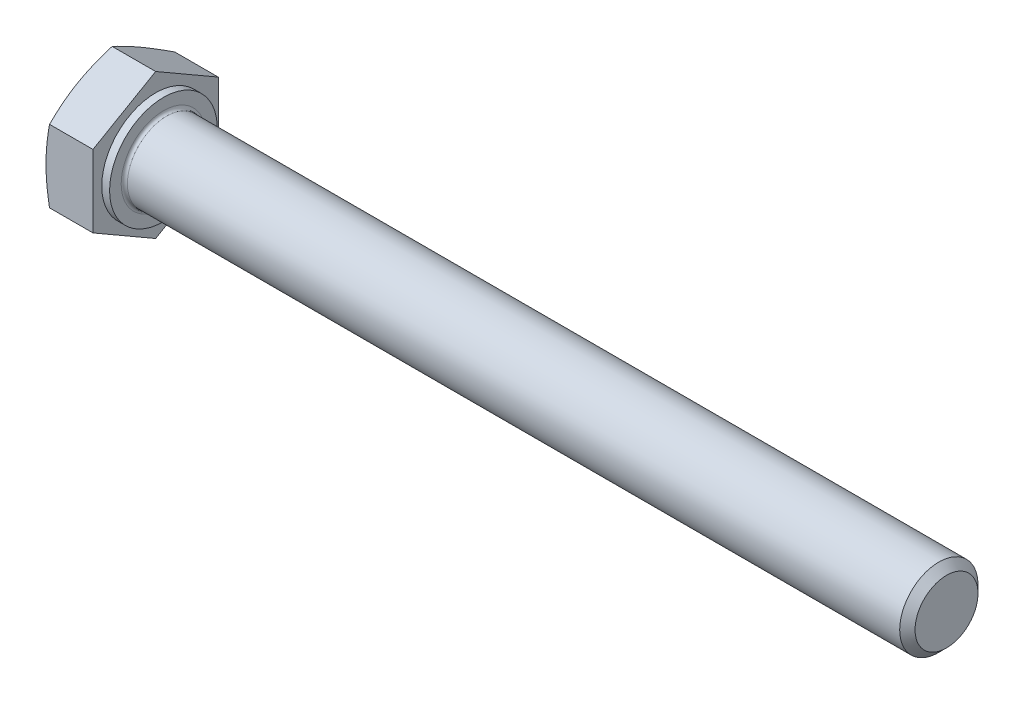
ISO-10303-21;
HEADER;
FILE_DESCRIPTION(('STEP AP214'),'2;1');
FILE_NAME('part.step','',(''),(''),'','','');
FILE_SCHEMA(('AUTOMOTIVE_DESIGN { 1 0 10303 214 1 1 1 1 }'));
ENDSEC;
DATA;
#1=APPLICATION_CONTEXT('core data for automotive mechanical design processes');
#2=APPLICATION_PROTOCOL_DEFINITION('international standard','automotive_design',2000,#1);
#3=PRODUCT_CONTEXT('',#1,'mechanical');
#4=PRODUCT('Part','Part','',(#3));
#5=PRODUCT_RELATED_PRODUCT_CATEGORY('part','',(#4));
#6=PRODUCT_DEFINITION_FORMATION('','',#4);
#7=PRODUCT_DEFINITION_CONTEXT('part definition',#1,'design');
#8=PRODUCT_DEFINITION('design','',#6,#7);
#9=PRODUCT_DEFINITION_SHAPE('','',#8);
#10=(LENGTH_UNIT() NAMED_UNIT(*) SI_UNIT(.MILLI.,.METRE.));
#11=(NAMED_UNIT(*) PLANE_ANGLE_UNIT() SI_UNIT($,.RADIAN.));
#12=(NAMED_UNIT(*) SI_UNIT($,.STERADIAN.) SOLID_ANGLE_UNIT());
#13=UNCERTAINTY_MEASURE_WITH_UNIT(LENGTH_MEASURE(1.E-05),#10,'distance_accuracy_value','');
#14=(GEOMETRIC_REPRESENTATION_CONTEXT(3) GLOBAL_UNCERTAINTY_ASSIGNED_CONTEXT((#13)) GLOBAL_UNIT_ASSIGNED_CONTEXT((#10,
#11,#12)) REPRESENTATION_CONTEXT('',''));
#15=CARTESIAN_POINT('',(0.,0.,0.));
#16=DIRECTION('',(0.,0.,1.));
#17=DIRECTION('',(1.,0.,0.));
#18=AXIS2_PLACEMENT_3D('',#15,#16,#17);
#19=CARTESIAN_POINT('',(-3.5,2.,0.));
#20=DIRECTION('',(-1.,0.,0.));
#21=DIRECTION('',(0.,0.,1.));
#22=AXIS2_PLACEMENT_3D('',#19,#20,#21);
#23=PLANE('',#22);
#24=CARTESIAN_POINT('',(-3.49999999997659,0.,0.));
#25=DIRECTION('',(1.,0.,0.));
#26=DIRECTION('',(0.,0.,-1.));
#27=AXIS2_PLACEMENT_3D('',#24,#25,#26);
#28=CIRCLE('',#27,4.00000000007594);
#29=CARTESIAN_POINT('',(-3.49999999999041,0.,4.00000000003797));
#30=VERTEX_POINT('',#29);
#31=CARTESIAN_POINT('',(-3.49999999999041,-3.46410161517064,2.00000000001898));
#32=VERTEX_POINT('',#31);
#33=EDGE_CURVE('E91',#30,#32,#28,.T.);
#34=ORIENTED_EDGE('',*,*,#33,.F.);
#35=CARTESIAN_POINT('',(-3.49999999997659,0.,0.));
#36=DIRECTION('',(1.,0.,0.));
#37=DIRECTION('',(0.,0.,-1.));
#38=AXIS2_PLACEMENT_3D('',#35,#36,#37);
#39=CIRCLE('',#38,4.00000000007594);
#40=CARTESIAN_POINT('',(-3.49999999999041,3.46410161517064,2.00000000001898));
#41=VERTEX_POINT('',#40);
#42=EDGE_CURVE('E88',#41,#30,#39,.T.);
#43=ORIENTED_EDGE('',*,*,#42,.F.);
#44=CARTESIAN_POINT('',(-3.49999999997659,0.,0.));
#45=DIRECTION('',(1.,0.,0.));
#46=DIRECTION('',(0.,0.,-1.));
#47=AXIS2_PLACEMENT_3D('',#44,#45,#46);
#48=CIRCLE('',#47,4.00000000007594);
#49=CARTESIAN_POINT('',(-3.49999999999041,3.46410161517064,-2.00000000001899));
#50=VERTEX_POINT('',#49);
#51=EDGE_CURVE('E20',#50,#41,#48,.T.);
#52=ORIENTED_EDGE('',*,*,#51,.F.);
#53=CARTESIAN_POINT('',(-3.49999999997659,0.,0.));
#54=DIRECTION('',(1.,0.,0.));
#55=DIRECTION('',(0.,0.,-1.));
#56=AXIS2_PLACEMENT_3D('',#53,#54,#55);
#57=CIRCLE('',#56,4.00000000007594);
#58=CARTESIAN_POINT('',(-3.49999999999041,0.,-4.00000000003797));
#59=VERTEX_POINT('',#58);
#60=EDGE_CURVE('E458',#59,#50,#57,.T.);
#61=ORIENTED_EDGE('',*,*,#60,.F.);
#62=CARTESIAN_POINT('',(-3.49999999997659,0.,0.));
#63=DIRECTION('',(1.,0.,0.));
#64=DIRECTION('',(0.,0.,-1.));
#65=AXIS2_PLACEMENT_3D('',#62,#63,#64);
#66=CIRCLE('',#65,4.00000000007594);
#67=CARTESIAN_POINT('',(-3.49999999999041,-3.46410161517064,-2.00000000001898));
#68=VERTEX_POINT('',#67);
#69=EDGE_CURVE('E144',#68,#59,#66,.T.);
#70=ORIENTED_EDGE('',*,*,#69,.F.);
#71=CARTESIAN_POINT('',(-3.49999999997659,0.,0.));
#72=DIRECTION('',(1.,0.,0.));
#73=DIRECTION('',(0.,0.,-1.));
#74=AXIS2_PLACEMENT_3D('',#71,#72,#73);
#75=CIRCLE('',#74,4.00000000007594);
#76=EDGE_CURVE('E461',#32,#68,#75,.T.);
#77=ORIENTED_EDGE('',*,*,#76,.F.);
#78=EDGE_LOOP('',(#34,#43,#52,#61,#70,#77));
#79=FACE_BOUND('',#78,.T.);
#80=ADVANCED_FACE('F17',(#79),#23,.T.);
#81=CARTESIAN_POINT('',(-3.27342308187895,0.,0.));
#82=DIRECTION('',(1.,0.,0.));
#83=DIRECTION('',(0.,0.,-1.));
#84=AXIS2_PLACEMENT_3D('',#81,#82,#83);
#85=CONICAL_SURFACE('',#84,4.62251496634281,1.22173047640841);
#86=CARTESIAN_POINT('',(-3.27477443523247,4.61880215351814,1.9678651007818E-12));
#87=CARTESIAN_POINT('',(-3.30947465057823,4.52349006431418,-0.165085381074832));
#88=CARTESIAN_POINT('',(-3.34105286383211,4.42786762538426,-0.330708303645098));
#89=CARTESIAN_POINT('',(-3.39656371900765,4.23627675616722,-0.662553423395305));
#90=CARTESIAN_POINT('',(-3.42051210955656,4.14030945750729,-0.828773660539435));
#91=CARTESIAN_POINT('',(-3.45952558471782,3.94786485008672,-1.16209749823451));
#92=CARTESIAN_POINT('',(-3.47458678229017,3.85138733675634,-1.32920145311064));
#93=CARTESIAN_POINT('',(-3.48977188057655,3.70638377667277,-1.58035498645374));
#94=CARTESIAN_POINT('',(-3.49359924532291,3.65794973846843,-1.66424520143939));
#95=CARTESIAN_POINT('',(-3.4987165806347,3.56104518672895,-1.83208880853686));
#96=CARTESIAN_POINT('',(-3.50000638935347,3.51257467106449,-1.91604220433678));
#97=CARTESIAN_POINT('',(-3.50000000000423,3.4641016151372,-2.00000000000096));
#98=B_SPLINE_CURVE_WITH_KNOTS('',3,(#86,#87,#88,#89,#90,#91,#92,#93,#94,#95,#96,#97),
.UNSPECIFIED.,.F.,.F.,(4,2,2,2,2,4),(0.,0.58131973204969,1.16143167607339,1.74179715910975,
2.03259877876568,2.32341894530133),.UNSPECIFIED.);
#99=CARTESIAN_POINT('',(-3.27477443523247,4.61880215351814,0.));
#100=VERTEX_POINT('',#99);
#101=EDGE_CURVE('E108',#100,#50,#98,.T.);
#102=ORIENTED_EDGE('',*,*,#101,.T.);
#103=ORIENTED_EDGE('',*,*,#51,.T.);
#104=CARTESIAN_POINT('',(-3.5000000000103,3.46410161514526,2.00000000000433));
#105=CARTESIAN_POINT('',(-3.5000063893557,3.51257467106773,1.91604220433754));
#106=CARTESIAN_POINT('',(-3.4987165806353,3.56104518673013,1.83208880853657));
#107=CARTESIAN_POINT('',(-3.49359924532227,3.657949738468,1.66424520143839));
#108=CARTESIAN_POINT('',(-3.48977188057631,3.7063837766728,1.58035498645309));
#109=CARTESIAN_POINT('',(-3.47458678229057,3.85138733675708,1.32920145311058));
#110=CARTESIAN_POINT('',(-3.45952558471791,3.94786485008704,1.16209749823431));
#111=CARTESIAN_POINT('',(-3.42051210955641,4.14030945750725,0.828773660539154));
#112=CARTESIAN_POINT('',(-3.39656371900756,4.23627675616725,0.662553423395082));
#113=CARTESIAN_POINT('',(-3.34105286383215,4.4278676253844,0.330708303645032));
#114=CARTESIAN_POINT('',(-3.30947465057834,4.52349006431436,0.165085381074863));
#115=CARTESIAN_POINT('',(-3.27477443523247,4.61880215351814,-1.96868278240485E-12));
#116=B_SPLINE_CURVE_WITH_KNOTS('',3,(#104,#105,#106,#107,#108,#109,#110,#111,#112,#113,#114,
#115),.UNSPECIFIED.,.F.,.F.,(4,2,2,2,2,4),(0.,0.29082016653535,0.581621786191063,
1.16198726922716,1.74209921325081,2.3234189453003),.UNSPECIFIED.);
#117=EDGE_CURVE('E102',#41,#100,#116,.T.);
#118=ORIENTED_EDGE('',*,*,#117,.T.);
#119=EDGE_LOOP('',(#102,#103,#118));
#120=FACE_BOUND('',#119,.T.);
#121=ADVANCED_FACE('F106',(#120),#85,.T.);
#122=CARTESIAN_POINT('',(-3.27342308187895,0.,0.));
#123=DIRECTION('',(1.,0.,0.));
#124=DIRECTION('',(0.,0.,-1.));
#125=AXIS2_PLACEMENT_3D('',#122,#123,#124);
#126=CONICAL_SURFACE('',#125,4.62251496634281,1.22173047640841);
#127=CARTESIAN_POINT('',(-3.27477443523247,2.30940107675737,4.00000000000197));
#128=CARTESIAN_POINT('',(-3.30947465057823,2.40471316596133,3.83491461892517));
#129=CARTESIAN_POINT('',(-3.34105286383211,2.50033560489125,3.6692916963549));
#130=CARTESIAN_POINT('',(-3.39656371900765,2.69192647410829,3.3374465766047));
#131=CARTESIAN_POINT('',(-3.42051210955656,2.78789377276822,3.17122633946057));
#132=CARTESIAN_POINT('',(-3.45952558471782,2.98033838018879,2.83790250176549));
#133=CARTESIAN_POINT('',(-3.47458678229017,3.07681589351917,2.67079854688936));
#134=CARTESIAN_POINT('',(-3.48977188057655,3.22181945360274,2.41964501354626));
#135=CARTESIAN_POINT('',(-3.49359924532291,3.27025349180708,2.3357547985606));
#136=CARTESIAN_POINT('',(-3.4987165806347,3.36715804354656,2.16791119146314));
#137=CARTESIAN_POINT('',(-3.50000638935347,3.41562855921102,2.08395779566322));
#138=CARTESIAN_POINT('',(-3.50000000000423,3.46410161513831,1.99999999999904));
#139=B_SPLINE_CURVE_WITH_KNOTS('',3,(#127,#128,#129,#130,#131,#132,#133,#134,#135,#136,#137,
#138),.UNSPECIFIED.,.F.,.F.,(4,2,2,2,2,4),(0.,0.58131973204969,1.16143167607339,
1.74179715910976,2.03259877876568,2.32341894530133),.UNSPECIFIED.);
#140=CARTESIAN_POINT('',(-3.27477443523247,2.30940107675907,4.00000000000098));
#141=VERTEX_POINT('',#140);
#142=EDGE_CURVE('E96',#141,#41,#139,.T.);
#143=ORIENTED_EDGE('',*,*,#142,.T.);
#144=ORIENTED_EDGE('',*,*,#42,.T.);
#145=CARTESIAN_POINT('',(-3.5000000000103,0.,4.00000000000867));
#146=CARTESIAN_POINT('',(-3.5000063893557,0.0969461118544172,4.0000000000032));
#147=CARTESIAN_POINT('',(-3.4987165806353,0.193887143183226,4.00000000000087));
#148=CARTESIAN_POINT('',(-3.49359924532227,0.387696246661998,3.99999999999912));
#149=CARTESIAN_POINT('',(-3.48977188057631,0.484564323070614,3.99999999999969));
#150=CARTESIAN_POINT('',(-3.47458678229057,0.77457144323759,4.00000000000061));
#151=CARTESIAN_POINT('',(-3.45952558471791,0.967526469898265,4.00000000000017));
#152=CARTESIAN_POINT('',(-3.42051210955641,1.3524156847393,3.99999999999983));
#153=CARTESIAN_POINT('',(-3.39656371900756,1.54435028205914,3.99999999999991));
#154=CARTESIAN_POINT('',(-3.34105286383215,1.92753202049315,4.00000000000009));
#155=CARTESIAN_POINT('',(-3.30947465057834,2.11877689835292,4.00000000000017));
#156=CARTESIAN_POINT('',(-3.27477443523247,2.30940107676078,4.));
#157=B_SPLINE_CURVE_WITH_KNOTS('',3,(#145,#146,#147,#148,#149,#150,#151,#152,#153,#154,#155,
#156),.UNSPECIFIED.,.F.,.F.,(4,2,2,2,2,4),(0.,0.29082016653535,0.581621786191063,
1.16198726922716,1.74209921325081,2.3234189453003),.UNSPECIFIED.);
#158=EDGE_CURVE('E98',#30,#141,#157,.T.);
#159=ORIENTED_EDGE('',*,*,#158,.T.);
#160=EDGE_LOOP('',(#143,#144,#159));
#161=FACE_BOUND('',#160,.T.);
#162=ADVANCED_FACE('F97',(#161),#126,.T.);
#163=CARTESIAN_POINT('',(-3.27342308187895,0.,0.));
#164=DIRECTION('',(1.,0.,0.));
#165=DIRECTION('',(0.,0.,-1.));
#166=AXIS2_PLACEMENT_3D('',#163,#164,#165);
#167=CONICAL_SURFACE('',#166,4.62251496634281,1.22173047640841);
#168=CARTESIAN_POINT('',(-3.27477443523247,-2.30940107676078,4.));
#169=CARTESIAN_POINT('',(-3.30947465057823,-2.11877689835285,4.));
#170=CARTESIAN_POINT('',(-3.34105286383211,-1.92753202049302,4.));
#171=CARTESIAN_POINT('',(-3.39656371900765,-1.54435028205893,4.));
#172=CARTESIAN_POINT('',(-3.42051210955656,-1.35241568473908,4.));
#173=CARTESIAN_POINT('',(-3.45952558471782,-0.967526469897932,4.));
#174=CARTESIAN_POINT('',(-3.47458678229017,-0.774571443237161,4.));
#175=CARTESIAN_POINT('',(-3.48977188057655,-0.484564323070031,4.));
#176=CARTESIAN_POINT('',(-3.49359924532291,-0.387696246661349,4.));
#177=CARTESIAN_POINT('',(-3.4987165806347,-0.19388714318239,4.));
#178=CARTESIAN_POINT('',(-3.50000638935347,-0.0969461118534611,4.));
#179=CARTESIAN_POINT('',(-3.50000000000423,1.10484079138364E-12,4.));
#180=B_SPLINE_CURVE_WITH_KNOTS('',3,(#168,#169,#170,#171,#172,#173,#174,#175,#176,#177,#178,
#179),.UNSPECIFIED.,.F.,.F.,(4,2,2,2,2,4),(0.,0.58131973204969,1.16143167607339,
1.74179715910976,2.03259877876568,2.32341894530133),.UNSPECIFIED.);
#181=CARTESIAN_POINT('',(-3.27477443523247,-2.30940107675907,4.00000000000098));
#182=VERTEX_POINT('',#181);
#183=EDGE_CURVE('E115',#182,#30,#180,.T.);
#184=ORIENTED_EDGE('',*,*,#183,.T.);
#185=ORIENTED_EDGE('',*,*,#33,.T.);
#186=CARTESIAN_POINT('',(-3.5000000000103,-3.46410161514526,2.00000000000433));
#187=CARTESIAN_POINT('',(-3.5000063893557,-3.41562855921332,2.08395779566565));
#188=CARTESIAN_POINT('',(-3.4987165806353,-3.3671580435469,2.1679111914643));
#189=CARTESIAN_POINT('',(-3.49359924532227,-3.270253491806,2.33575479856073));
#190=CARTESIAN_POINT('',(-3.48977188057631,-3.22181945360218,2.41964501354661));
#191=CARTESIAN_POINT('',(-3.47458678229057,-3.07681589351949,2.67079854689003));
#192=CARTESIAN_POINT('',(-3.45952558471791,-2.98033838018877,2.83790250176586));
#193=CARTESIAN_POINT('',(-3.42051210955641,-2.78789377276796,3.17122633946067));
#194=CARTESIAN_POINT('',(-3.39656371900756,-2.69192647410811,3.33744657660483));
#195=CARTESIAN_POINT('',(-3.34105286383215,-2.50033560489126,3.66929169635506));
#196=CARTESIAN_POINT('',(-3.30947465057834,-2.40471316596145,3.83491461892531));
#197=CARTESIAN_POINT('',(-3.27477443523247,-2.30940107675737,4.00000000000197));
#198=B_SPLINE_CURVE_WITH_KNOTS('',3,(#186,#187,#188,#189,#190,#191,#192,#193,#194,#195,#196,
#197),.UNSPECIFIED.,.F.,.F.,(4,2,2,2,2,4),(0.,0.290820166535351,0.581621786191064,
1.16198726922716,1.74209921325081,2.32341894530031),.UNSPECIFIED.);
#199=EDGE_CURVE('E219',#32,#182,#198,.T.);
#200=ORIENTED_EDGE('',*,*,#199,.T.);
#201=EDGE_LOOP('',(#184,#185,#200));
#202=FACE_BOUND('',#201,.T.);
#203=ADVANCED_FACE('F209',(#202),#167,.T.);
#204=CARTESIAN_POINT('',(-3.27342308187895,0.,0.));
#205=DIRECTION('',(1.,0.,0.));
#206=DIRECTION('',(0.,0.,-1.));
#207=AXIS2_PLACEMENT_3D('',#204,#205,#206);
#208=CONICAL_SURFACE('',#207,4.62251496634281,1.22173047640841);
#209=ORIENTED_EDGE('',*,*,#76,.T.);
#210=CARTESIAN_POINT('',(-3.5000000000103,-3.46410161514526,-2.00000000000433));
#211=CARTESIAN_POINT('',(-3.5000063893557,-3.51257467106773,-1.91604220433754));
#212=CARTESIAN_POINT('',(-3.4987165806353,-3.56104518673013,-1.83208880853657));
#213=CARTESIAN_POINT('',(-3.49359924532227,-3.657949738468,-1.66424520143839));
#214=CARTESIAN_POINT('',(-3.48977188057631,-3.7063837766728,-1.58035498645308));
#215=CARTESIAN_POINT('',(-3.47458678229057,-3.85138733675708,-1.32920145311058));
#216=CARTESIAN_POINT('',(-3.45952558471791,-3.94786485008704,-1.16209749823431));
#217=CARTESIAN_POINT('',(-3.42051210955641,-4.14030945750725,-0.828773660539154));
#218=CARTESIAN_POINT('',(-3.39656371900756,-4.23627675616725,-0.662553423395082));
#219=CARTESIAN_POINT('',(-3.34105286383215,-4.4278676253844,-0.330708303645031));
#220=CARTESIAN_POINT('',(-3.30947465057834,-4.52349006431436,-0.165085381074863));
#221=CARTESIAN_POINT('',(-3.27477443523247,-4.61880215351814,1.96865973761618E-12));
#222=B_SPLINE_CURVE_WITH_KNOTS('',3,(#210,#211,#212,#213,#214,#215,#216,#217,#218,#219,#220,
#221),.UNSPECIFIED.,.F.,.F.,(4,2,2,2,2,4),(0.,0.29082016653535,0.581621786191063,
1.16198726922716,1.7420992132508,2.3234189453003),.UNSPECIFIED.);
#223=CARTESIAN_POINT('',(-3.27477443523247,-4.61880215351814,0.));
#224=VERTEX_POINT('',#223);
#225=EDGE_CURVE('E201',#68,#224,#222,.T.);
#226=ORIENTED_EDGE('',*,*,#225,.T.);
#227=CARTESIAN_POINT('',(-3.27477443523247,-4.61880215351814,-1.96770084854492E-12));
#228=CARTESIAN_POINT('',(-3.30947465057823,-4.52349006431418,0.165085381074832));
#229=CARTESIAN_POINT('',(-3.34105286383211,-4.42786762538426,0.330708303645098));
#230=CARTESIAN_POINT('',(-3.39656371900765,-4.23627675616722,0.662553423395304));
#231=CARTESIAN_POINT('',(-3.42051210955656,-4.14030945750729,0.828773660539433));
#232=CARTESIAN_POINT('',(-3.45952558471782,-3.94786485008672,1.16209749823451));
#233=CARTESIAN_POINT('',(-3.47458678229017,-3.85138733675634,1.32920145311064));
#234=CARTESIAN_POINT('',(-3.48977188057655,-3.70638377667277,1.58035498645374));
#235=CARTESIAN_POINT('',(-3.49359924532291,-3.65794973846843,1.66424520143939));
#236=CARTESIAN_POINT('',(-3.4987165806347,-3.56104518672895,1.83208880853686));
#237=CARTESIAN_POINT('',(-3.50000638935347,-3.51257467106449,1.91604220433677));
#238=CARTESIAN_POINT('',(-3.50000000000423,-3.4641016151372,2.00000000000096));
#239=B_SPLINE_CURVE_WITH_KNOTS('',3,(#227,#228,#229,#230,#231,#232,#233,#234,#235,#236,#237,
#238),.UNSPECIFIED.,.F.,.F.,(4,2,2,2,2,4),(0.,0.581319732049689,1.16143167607339,
1.74179715910975,2.03259877876568,2.32341894530133),.UNSPECIFIED.);
#240=EDGE_CURVE('E214',#224,#32,#239,.T.);
#241=ORIENTED_EDGE('',*,*,#240,.T.);
#242=EDGE_LOOP('',(#209,#226,#241));
#243=FACE_BOUND('',#242,.T.);
#244=ADVANCED_FACE('F206',(#243),#208,.T.);
#245=CARTESIAN_POINT('',(-3.27342308187895,0.,0.));
#246=DIRECTION('',(1.,0.,0.));
#247=DIRECTION('',(0.,0.,-1.));
#248=AXIS2_PLACEMENT_3D('',#245,#246,#247);
#249=CONICAL_SURFACE('',#248,4.62251496634281,1.22173047640841);
#250=ORIENTED_EDGE('',*,*,#60,.T.);
#251=CARTESIAN_POINT('',(-3.5000000000103,3.46410161514526,-2.00000000000433));
#252=CARTESIAN_POINT('',(-3.5000063893557,3.41562855921331,-2.08395779566565));
#253=CARTESIAN_POINT('',(-3.4987165806353,3.3671580435469,-2.1679111914643));
#254=CARTESIAN_POINT('',(-3.49359924532227,3.270253491806,-2.33575479856073));
#255=CARTESIAN_POINT('',(-3.48977188057631,3.22181945360218,-2.41964501354661));
#256=CARTESIAN_POINT('',(-3.47458678229057,3.07681589351949,-2.67079854689003));
#257=CARTESIAN_POINT('',(-3.45952558471791,2.98033838018877,-2.83790250176586));
#258=CARTESIAN_POINT('',(-3.42051210955641,2.78789377276796,-3.17122633946067));
#259=CARTESIAN_POINT('',(-3.39656371900756,2.69192647410811,-3.33744657660483));
#260=CARTESIAN_POINT('',(-3.34105286383215,2.50033560489126,-3.66929169635505));
#261=CARTESIAN_POINT('',(-3.30947465057834,2.40471316596145,-3.83491461892531));
#262=CARTESIAN_POINT('',(-3.27477443523247,2.30940107675737,-4.00000000000197));
#263=B_SPLINE_CURVE_WITH_KNOTS('',3,(#251,#252,#253,#254,#255,#256,#257,#258,#259,#260,#261,
#262),.UNSPECIFIED.,.F.,.F.,(4,2,2,2,2,4),(0.,0.29082016653535,0.581621786191063,
1.16198726922716,1.74209921325081,2.3234189453003),.UNSPECIFIED.);
#264=CARTESIAN_POINT('',(-3.27477443523268,2.30940107675794,-4.00000000000098));
#265=VERTEX_POINT('',#264);
#266=EDGE_CURVE('E103',#50,#265,#263,.T.);
#267=ORIENTED_EDGE('',*,*,#266,.T.);
#268=CARTESIAN_POINT('',(-3.27477443523247,2.30940107676078,-4.));
#269=CARTESIAN_POINT('',(-3.30947465057823,2.11877689835285,-4.));
#270=CARTESIAN_POINT('',(-3.34105286383211,1.92753202049302,-4.));
#271=CARTESIAN_POINT('',(-3.39656371900765,1.54435028205893,-4.));
#272=CARTESIAN_POINT('',(-3.42051210955656,1.35241568473908,-4.));
#273=CARTESIAN_POINT('',(-3.45952558471782,0.967526469897932,-4.));
#274=CARTESIAN_POINT('',(-3.47458678229017,0.774571443237161,-4.));
#275=CARTESIAN_POINT('',(-3.48977188057655,0.484564323070031,-4.));
#276=CARTESIAN_POINT('',(-3.49359924532291,0.387696246661349,-4.));
#277=CARTESIAN_POINT('',(-3.4987165806347,0.193887143182389,-4.));
#278=CARTESIAN_POINT('',(-3.50000638935347,0.0969461118534606,-4.));
#279=CARTESIAN_POINT('',(-3.50000000000423,-1.10527447225264E-12,-4.));
#280=B_SPLINE_CURVE_WITH_KNOTS('',3,(#268,#269,#270,#271,#272,#273,#274,#275,#276,#277,#278,
#279),.UNSPECIFIED.,.F.,.F.,(4,2,2,2,2,4),(0.,0.58131973204969,1.16143167607339,
1.74179715910976,2.03259877876568,2.32341894530133),.UNSPECIFIED.);
#281=EDGE_CURVE('E180',#265,#59,#280,.T.);
#282=ORIENTED_EDGE('',*,*,#281,.T.);
#283=EDGE_LOOP('',(#250,#267,#282));
#284=FACE_BOUND('',#283,.T.);
#285=ADVANCED_FACE('F159',(#284),#249,.T.);
#286=CARTESIAN_POINT('',(-3.27342308187895,0.,0.));
#287=DIRECTION('',(1.,0.,0.));
#288=DIRECTION('',(0.,0.,-1.));
#289=AXIS2_PLACEMENT_3D('',#286,#287,#288);
#290=CONICAL_SURFACE('',#289,4.62251496634281,1.22173047640841);
#291=ORIENTED_EDGE('',*,*,#69,.T.);
#292=CARTESIAN_POINT('',(-3.5000000000103,0.,-4.00000000000867));
#293=CARTESIAN_POINT('',(-3.5000063893557,-0.0969461118544174,-4.0000000000032));
#294=CARTESIAN_POINT('',(-3.4987165806353,-0.193887143183226,-4.00000000000087));
#295=CARTESIAN_POINT('',(-3.49359924532227,-0.387696246661999,-3.99999999999912));
#296=CARTESIAN_POINT('',(-3.48977188057631,-0.484564323070614,-3.99999999999969));
#297=CARTESIAN_POINT('',(-3.47458678229057,-0.77457144323759,-4.00000000000061));
#298=CARTESIAN_POINT('',(-3.45952558471791,-0.967526469898266,-4.00000000000017));
#299=CARTESIAN_POINT('',(-3.42051210955641,-1.3524156847393,-3.99999999999983));
#300=CARTESIAN_POINT('',(-3.39656371900756,-1.54435028205914,-3.99999999999991));
#301=CARTESIAN_POINT('',(-3.34105286383215,-1.92753202049315,-4.00000000000009));
#302=CARTESIAN_POINT('',(-3.30947465057834,-2.11877689835292,-4.00000000000017));
#303=CARTESIAN_POINT('',(-3.27477443523247,-2.30940107676078,-4.));
#304=B_SPLINE_CURVE_WITH_KNOTS('',3,(#292,#293,#294,#295,#296,#297,#298,#299,#300,#301,#302,
#303),.UNSPECIFIED.,.F.,.F.,(4,2,2,2,2,4),(0.,0.29082016653535,0.581621786191063,
1.16198726922716,1.74209921325081,2.3234189453003),.UNSPECIFIED.);
#305=CARTESIAN_POINT('',(-3.27477443523247,-2.30940107675907,-4.00000000000098));
#306=VERTEX_POINT('',#305);
#307=EDGE_CURVE('E173',#59,#306,#304,.T.);
#308=ORIENTED_EDGE('',*,*,#307,.T.);
#309=CARTESIAN_POINT('',(-3.27477443523247,-2.30940107675737,-4.00000000000197));
#310=CARTESIAN_POINT('',(-3.30947465057823,-2.40471316596133,-3.83491461892517));
#311=CARTESIAN_POINT('',(-3.34105286383211,-2.50033560489125,-3.6692916963549));
#312=CARTESIAN_POINT('',(-3.39656371900765,-2.69192647410829,-3.3374465766047));
#313=CARTESIAN_POINT('',(-3.42051210955656,-2.78789377276822,-3.17122633946057));
#314=CARTESIAN_POINT('',(-3.45952558471782,-2.98033838018879,-2.83790250176549));
#315=CARTESIAN_POINT('',(-3.47458678229017,-3.07681589351918,-2.67079854688936));
#316=CARTESIAN_POINT('',(-3.48977188057655,-3.22181945360274,-2.41964501354625));
#317=CARTESIAN_POINT('',(-3.49359924532291,-3.27025349180708,-2.3357547985606));
#318=CARTESIAN_POINT('',(-3.4987165806347,-3.36715804354656,-2.16791119146314));
#319=CARTESIAN_POINT('',(-3.50000638935347,-3.41562855921102,-2.08395779566322));
#320=CARTESIAN_POINT('',(-3.50000000000423,-3.46410161513831,-1.99999999999904));
#321=B_SPLINE_CURVE_WITH_KNOTS('',3,(#309,#310,#311,#312,#313,#314,#315,#316,#317,#318,#319,
#320),.UNSPECIFIED.,.F.,.F.,(4,2,2,2,2,4),(0.,0.58131973204969,1.16143167607339,
1.74179715910976,2.03259877876569,2.32341894530133),.UNSPECIFIED.);
#322=EDGE_CURVE('E165',#306,#68,#321,.T.);
#323=ORIENTED_EDGE('',*,*,#322,.T.);
#324=EDGE_LOOP('',(#291,#308,#323));
#325=FACE_BOUND('',#324,.T.);
#326=ADVANCED_FACE('F154',(#325),#290,.T.);
#327=CARTESIAN_POINT('',(0.,4.61880215351701,0.));
#328=DIRECTION('',(0.,-0.866025403784439,0.5));
#329=DIRECTION('',(0.,-0.5,-0.866025403784439));
#330=AXIS2_PLACEMENT_3D('',#327,#328,#329);
#331=PLANE('',#330);
#332=DIRECTION('',(1.,0.,0.));
#333=VECTOR('',#332,1.);
#334=CARTESIAN_POINT('',(0.,2.3094010767585,-4.));
#335=LINE('',#334,#333);
#336=CARTESIAN_POINT('',(-0.5,2.3094010767585,-4.));
#337=VERTEX_POINT('',#336);
#338=EDGE_CURVE('E338',#337,#265,#335,.F.);
#339=ORIENTED_EDGE('',*,*,#338,.T.);
#340=ORIENTED_EDGE('',*,*,#266,.F.);
#341=ORIENTED_EDGE('',*,*,#101,.F.);
#342=DIRECTION('',(1.,0.,0.));
#343=VECTOR('',#342,1.);
#344=CARTESIAN_POINT('',(0.,4.61880215351701,0.));
#345=LINE('',#344,#343);
#346=CARTESIAN_POINT('',(-0.5,4.61880215351701,0.));
#347=VERTEX_POINT('',#346);
#348=EDGE_CURVE('E113',#100,#347,#345,.T.);
#349=ORIENTED_EDGE('',*,*,#348,.T.);
#350=DIRECTION('',(0.,0.5,0.866025403784439));
#351=VECTOR('',#350,1.);
#352=CARTESIAN_POINT('',(-0.5,2.3094010767585,-4.));
#353=LINE('',#352,#351);
#354=EDGE_CURVE('E303',#337,#347,#353,.T.);
#355=ORIENTED_EDGE('',*,*,#354,.F.);
#356=EDGE_LOOP('',(#339,#340,#341,#349,#355));
#357=FACE_BOUND('',#356,.T.);
#358=ADVANCED_FACE('F150',(#357),#331,.F.);
#359=CARTESIAN_POINT('',(0.,2.3094010767585,4.));
#360=DIRECTION('',(0.,-0.866025403784439,-0.5));
#361=DIRECTION('',(0.,0.5,-0.866025403784439));
#362=AXIS2_PLACEMENT_3D('',#359,#360,#361);
#363=PLANE('',#362);
#364=ORIENTED_EDGE('',*,*,#348,.F.);
#365=ORIENTED_EDGE('',*,*,#117,.F.);
#366=ORIENTED_EDGE('',*,*,#142,.F.);
#367=DIRECTION('',(-1.,0.,0.));
#368=VECTOR('',#367,1.);
#369=CARTESIAN_POINT('',(0.,2.3094010767585,4.));
#370=LINE('',#369,#368);
#371=CARTESIAN_POINT('',(-0.5,2.3094010767585,4.));
#372=VERTEX_POINT('',#371);
#373=EDGE_CURVE('E220',#141,#372,#370,.F.);
#374=ORIENTED_EDGE('',*,*,#373,.T.);
#375=DIRECTION('',(0.,-0.5,0.866025403784439));
#376=VECTOR('',#375,1.);
#377=CARTESIAN_POINT('',(-0.5,4.61880215351701,0.));
#378=LINE('',#377,#376);
#379=EDGE_CURVE('E299',#347,#372,#378,.T.);
#380=ORIENTED_EDGE('',*,*,#379,.F.);
#381=EDGE_LOOP('',(#364,#365,#366,#374,#380));
#382=FACE_BOUND('',#381,.T.);
#383=ADVANCED_FACE('F111',(#382),#363,.F.);
#384=CARTESIAN_POINT('',(0.,-2.3094010767585,4.));
#385=DIRECTION('',(0.,0.,-1.));
#386=DIRECTION('',(-1.,0.,0.));
#387=AXIS2_PLACEMENT_3D('',#384,#385,#386);
#388=PLANE('',#387);
#389=ORIENTED_EDGE('',*,*,#373,.F.);
#390=ORIENTED_EDGE('',*,*,#158,.F.);
#391=ORIENTED_EDGE('',*,*,#183,.F.);
#392=DIRECTION('',(1.,0.,0.));
#393=VECTOR('',#392,1.);
#394=CARTESIAN_POINT('',(0.,-2.3094010767585,4.));
#395=LINE('',#394,#393);
#396=CARTESIAN_POINT('',(-0.5,-2.3094010767585,4.));
#397=VERTEX_POINT('',#396);
#398=EDGE_CURVE('E333',#182,#397,#395,.T.);
#399=ORIENTED_EDGE('',*,*,#398,.T.);
#400=DIRECTION('',(0.,1.,0.));
#401=VECTOR('',#400,1.);
#402=CARTESIAN_POINT('',(-0.5,4.91999999999999,4.));
#403=LINE('',#402,#401);
#404=EDGE_CURVE('E302',#372,#397,#403,.F.);
#405=ORIENTED_EDGE('',*,*,#404,.F.);
#406=EDGE_LOOP('',(#389,#390,#391,#399,#405));
#407=FACE_BOUND('',#406,.T.);
#408=ADVANCED_FACE('F227',(#407),#388,.F.);
#409=CARTESIAN_POINT('',(0.,-4.61880215351701,0.));
#410=DIRECTION('',(0.,0.866025403784439,-0.5));
#411=DIRECTION('',(0.,0.5,0.866025403784439));
#412=AXIS2_PLACEMENT_3D('',#409,#410,#411);
#413=PLANE('',#412);
#414=ORIENTED_EDGE('',*,*,#398,.F.);
#415=ORIENTED_EDGE('',*,*,#199,.F.);
#416=ORIENTED_EDGE('',*,*,#240,.F.);
#417=DIRECTION('',(1.,0.,0.));
#418=VECTOR('',#417,1.);
#419=CARTESIAN_POINT('',(0.,-4.61880215351701,0.));
#420=LINE('',#419,#418);
#421=CARTESIAN_POINT('',(-0.5,-4.61880215351701,0.));
#422=VERTEX_POINT('',#421);
#423=EDGE_CURVE('E205',#224,#422,#420,.T.);
#424=ORIENTED_EDGE('',*,*,#423,.T.);
#425=DIRECTION('',(0.,-0.5,-0.866025403784439));
#426=VECTOR('',#425,1.);
#427=CARTESIAN_POINT('',(-0.5,-2.3094010767585,4.));
#428=LINE('',#427,#426);
#429=EDGE_CURVE('E308',#397,#422,#428,.T.);
#430=ORIENTED_EDGE('',*,*,#429,.F.);
#431=EDGE_LOOP('',(#414,#415,#416,#424,#430));
#432=FACE_BOUND('',#431,.T.);
#433=ADVANCED_FACE('F198',(#432),#413,.F.);
#434=CARTESIAN_POINT('',(0.,-2.3094010767585,-4.));
#435=DIRECTION('',(0.,0.866025403784439,0.5));
#436=DIRECTION('',(0.,-0.5,0.866025403784439));
#437=AXIS2_PLACEMENT_3D('',#434,#435,#436);
#438=PLANE('',#437);
#439=ORIENTED_EDGE('',*,*,#423,.F.);
#440=ORIENTED_EDGE('',*,*,#225,.F.);
#441=ORIENTED_EDGE('',*,*,#322,.F.);
#442=DIRECTION('',(1.,0.,0.));
#443=VECTOR('',#442,1.);
#444=CARTESIAN_POINT('',(0.,-2.3094010767585,-4.));
#445=LINE('',#444,#443);
#446=CARTESIAN_POINT('',(-0.5,-2.3094010767585,-4.));
#447=VERTEX_POINT('',#446);
#448=EDGE_CURVE('E35',#306,#447,#445,.T.);
#449=ORIENTED_EDGE('',*,*,#448,.T.);
#450=DIRECTION('',(0.,0.5,-0.866025403784439));
#451=VECTOR('',#450,1.);
#452=CARTESIAN_POINT('',(-0.5,-4.61880215351701,0.));
#453=LINE('',#452,#451);
#454=EDGE_CURVE('E313',#422,#447,#453,.T.);
#455=ORIENTED_EDGE('',*,*,#454,.F.);
#456=EDGE_LOOP('',(#439,#440,#441,#449,#455));
#457=FACE_BOUND('',#456,.T.);
#458=ADVANCED_FACE('F191',(#457),#438,.F.);
#459=CARTESIAN_POINT('',(0.,2.3094010767585,-4.));
#460=DIRECTION('',(0.,0.,1.));
#461=DIRECTION('',(1.,0.,0.));
#462=AXIS2_PLACEMENT_3D('',#459,#460,#461);
#463=PLANE('',#462);
#464=ORIENTED_EDGE('',*,*,#448,.F.);
#465=ORIENTED_EDGE('',*,*,#307,.F.);
#466=ORIENTED_EDGE('',*,*,#281,.F.);
#467=ORIENTED_EDGE('',*,*,#338,.F.);
#468=DIRECTION('',(0.,1.,0.));
#469=VECTOR('',#468,1.);
#470=CARTESIAN_POINT('',(-0.5,4.91999999999999,-4.));
#471=LINE('',#470,#469);
#472=EDGE_CURVE('E295',#447,#337,#471,.T.);
#473=ORIENTED_EDGE('',*,*,#472,.F.);
#474=EDGE_LOOP('',(#464,#465,#466,#467,#473));
#475=FACE_BOUND('',#474,.T.);
#476=ADVANCED_FACE('F186',(#475),#463,.F.);
#477=CARTESIAN_POINT('',(-0.5,4.91999999999999,0.));
#478=DIRECTION('',(1.,0.,0.));
#479=DIRECTION('',(0.,0.,-1.));
#480=AXIS2_PLACEMENT_3D('',#477,#478,#479);
#481=PLANE('',#480);
#482=CARTESIAN_POINT('',(-0.5,0.,0.));
#483=DIRECTION('',(-1.,0.,0.));
#484=DIRECTION('',(0.,0.,1.));
#485=AXIS2_PLACEMENT_3D('',#482,#483,#484);
#486=CIRCLE('',#485,3.44);
#487=CARTESIAN_POINT('',(-0.5,0.,3.44));
#488=VERTEX_POINT('',#487);
#489=EDGE_CURVE('E181',#488,#488,#486,.F.);
#490=ORIENTED_EDGE('',*,*,#489,.F.);
#491=EDGE_LOOP('',(#490));
#492=FACE_BOUND('',#491,.T.);
#493=ORIENTED_EDGE('',*,*,#454,.T.);
#494=ORIENTED_EDGE('',*,*,#472,.T.);
#495=ORIENTED_EDGE('',*,*,#354,.T.);
#496=ORIENTED_EDGE('',*,*,#379,.T.);
#497=ORIENTED_EDGE('',*,*,#404,.T.);
#498=ORIENTED_EDGE('',*,*,#429,.T.);
#499=EDGE_LOOP('',(#493,#494,#495,#496,#497,#498));
#500=FACE_BOUND('',#499,.T.);
#501=ADVANCED_FACE('F190',(#492,#500),#481,.T.);
#502=CARTESIAN_POINT('',(-0.25,0.,0.));
#503=DIRECTION('',(-1.,0.,0.));
#504=DIRECTION('',(0.,0.,1.));
#505=AXIS2_PLACEMENT_3D('',#502,#503,#504);
#506=CYLINDRICAL_SURFACE('',#505,3.44);
#507=ORIENTED_EDGE('',*,*,#489,.T.);
#508=EDGE_LOOP('',(#507));
#509=FACE_BOUND('',#508,.T.);
#510=CARTESIAN_POINT('',(0.,0.,0.));
#511=DIRECTION('',(-1.,0.,0.));
#512=DIRECTION('',(0.,0.,1.));
#513=AXIS2_PLACEMENT_3D('',#510,#511,#512);
#514=CIRCLE('',#513,3.44);
#515=CARTESIAN_POINT('',(0.,0.,3.44));
#516=VERTEX_POINT('',#515);
#517=EDGE_CURVE('E290',#516,#516,#514,.F.);
#518=ORIENTED_EDGE('',*,*,#517,.F.);
#519=EDGE_LOOP('',(#518));
#520=FACE_BOUND('',#519,.T.);
#521=ADVANCED_FACE('F277',(#509,#520),#506,.T.);
#522=CARTESIAN_POINT('',(50.,1.00475,0.));
#523=DIRECTION('',(1.,0.,0.));
#524=DIRECTION('',(0.,0.,-1.));
#525=AXIS2_PLACEMENT_3D('',#522,#523,#524);
#526=PLANE('',#525);
#527=CARTESIAN_POINT('',(49.9999999999545,0.,0.));
#528=DIRECTION('',(-1.,0.,0.));
#529=DIRECTION('',(0.,0.,1.));
#530=AXIS2_PLACEMENT_3D('',#527,#528,#529);
#531=CIRCLE('',#530,2.00949999992872);
#532=CARTESIAN_POINT('',(49.9999999999545,0.,2.00949999992872));
#533=VERTEX_POINT('',#532);
#534=EDGE_CURVE('E292',#533,#533,#531,.T.);
#535=ORIENTED_EDGE('',*,*,#534,.F.);
#536=EDGE_LOOP('',(#535));
#537=FACE_BOUND('',#536,.T.);
#538=ADVANCED_FACE('F275',(#537),#526,.T.);
#539=CARTESIAN_POINT('',(0.,3.07,0.));
#540=DIRECTION('',(1.,0.,0.));
#541=DIRECTION('',(0.,0.,-1.));
#542=AXIS2_PLACEMENT_3D('',#539,#540,#541);
#543=PLANE('',#542);
#544=CARTESIAN_POINT('',(0.,0.,0.));
#545=DIRECTION('',(1.,0.,0.));
#546=DIRECTION('',(0.,1.,0.));
#547=AXIS2_PLACEMENT_3D('',#544,#545,#546);
#548=CIRCLE('',#547,2.7);
#549=CARTESIAN_POINT('',(0.,2.7,0.));
#550=VERTEX_POINT('',#549);
#551=EDGE_CURVE('E262',#550,#550,#548,.T.);
#552=ORIENTED_EDGE('',*,*,#551,.F.);
#553=EDGE_LOOP('',(#552));
#554=FACE_BOUND('',#553,.T.);
#555=ORIENTED_EDGE('',*,*,#517,.T.);
#556=EDGE_LOOP('',(#555));
#557=FACE_BOUND('',#556,.T.);
#558=ADVANCED_FACE('F266',(#554,#557),#543,.T.);
#559=CARTESIAN_POINT('',(49.5094999999424,0.,0.));
#560=DIRECTION('',(-1.,0.,0.));
#561=DIRECTION('',(0.,0.,1.));
#562=AXIS2_PLACEMENT_3D('',#559,#560,#561);
#563=CONICAL_SURFACE('',#562,2.49999999999773,0.785398163455393);
#564=ORIENTED_EDGE('',*,*,#534,.T.);
#565=EDGE_LOOP('',(#564));
#566=FACE_BOUND('',#565,.T.);
#567=CARTESIAN_POINT('',(49.5095,0.,0.));
#568=DIRECTION('',(-1.,0.,0.));
#569=DIRECTION('',(0.,0.,1.));
#570=AXIS2_PLACEMENT_3D('',#567,#568,#569);
#571=CIRCLE('',#570,2.5);
#572=CARTESIAN_POINT('',(49.5095,0.,2.5));
#573=VERTEX_POINT('',#572);
#574=EDGE_CURVE('E26',#573,#573,#571,.T.);
#575=ORIENTED_EDGE('',*,*,#574,.F.);
#576=EDGE_LOOP('',(#575));
#577=FACE_BOUND('',#576,.T.);
#578=ADVANCED_FACE('F246',(#566,#577),#563,.T.);
#579=CARTESIAN_POINT('',(0.200000000000005,0.,0.));
#580=DIRECTION('',(-1.,0.,0.));
#581=DIRECTION('',(0.,0.,1.));
#582=AXIS2_PLACEMENT_3D('',#579,#580,#581);
#583=TOROIDAL_SURFACE('',#582,2.7,0.200000000000005);
#584=CARTESIAN_POINT('',(0.199999999999999,0.,0.));
#585=DIRECTION('',(-1.,0.,0.));
#586=DIRECTION('',(0.,0.,1.));
#587=AXIS2_PLACEMENT_3D('',#584,#585,#586);
#588=CIRCLE('',#587,2.5);
#589=CARTESIAN_POINT('',(0.199999999999999,0.,2.5));
#590=VERTEX_POINT('',#589);
#591=EDGE_CURVE('E11',#590,#590,#588,.F.);
#592=ORIENTED_EDGE('',*,*,#591,.F.);
#593=EDGE_LOOP('',(#592));
#594=FACE_BOUND('',#593,.T.);
#595=ORIENTED_EDGE('',*,*,#551,.T.);
#596=EDGE_LOOP('',(#595));
#597=FACE_BOUND('',#596,.T.);
#598=ADVANCED_FACE('F240',(#594,#597),#583,.F.);
#599=CARTESIAN_POINT('',(24.85475,0.,0.));
#600=DIRECTION('',(-1.,0.,0.));
#601=DIRECTION('',(0.,0.,1.));
#602=AXIS2_PLACEMENT_3D('',#599,#600,#601);
#603=CYLINDRICAL_SURFACE('',#602,2.5);
#604=ORIENTED_EDGE('',*,*,#574,.T.);
#605=EDGE_LOOP('',(#604));
#606=FACE_BOUND('',#605,.T.);
#607=ORIENTED_EDGE('',*,*,#591,.T.);
#608=EDGE_LOOP('',(#607));
#609=FACE_BOUND('',#608,.T.);
#610=ADVANCED_FACE('F238',(#606,#609),#603,.T.);
#611=CLOSED_SHELL('',(#80,#121,#162,#203,#244,#285,#326,#358,#383,#408,#433,#458,#476,#501,#521,
#538,#558,#578,#598,#610));
#612=MANIFOLD_SOLID_BREP('B1',#611);
#613=ADVANCED_BREP_SHAPE_REPRESENTATION('',(#18,#612),#14);
#614=SHAPE_DEFINITION_REPRESENTATION(#9,#613);
ENDSEC;
END-ISO-10303-21;
